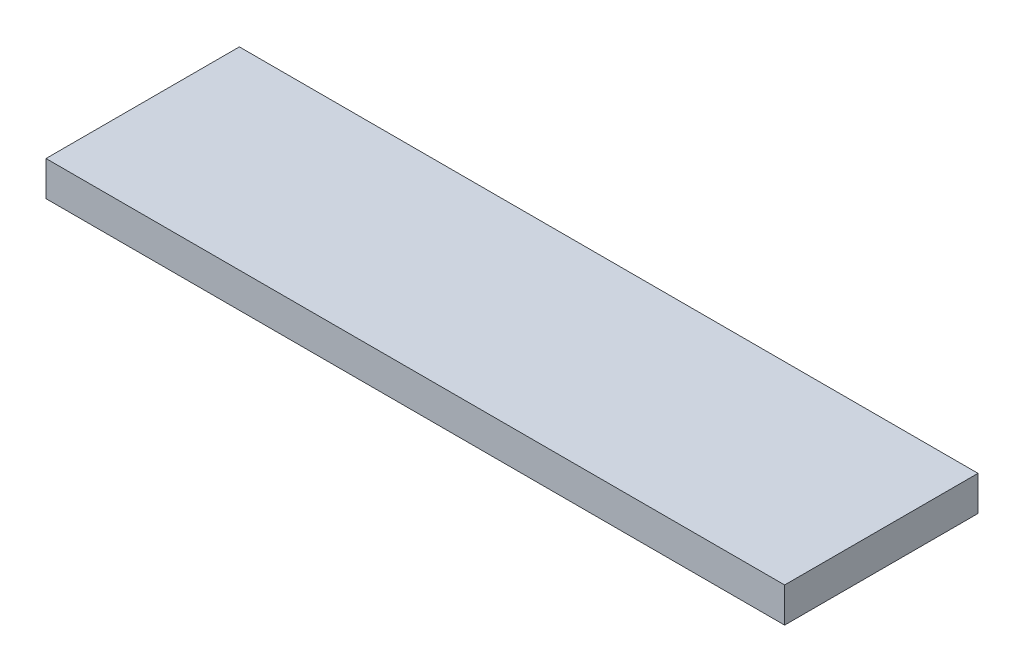
ISO-10303-21;
HEADER;
FILE_DESCRIPTION(('STEP AP214'),'2;1');
FILE_NAME('part.step','',(''),(''),'','','');
FILE_SCHEMA(('AUTOMOTIVE_DESIGN { 1 0 10303 214 1 1 1 1 }'));
ENDSEC;
DATA;
#1=APPLICATION_CONTEXT('core data for automotive mechanical design processes');
#2=APPLICATION_PROTOCOL_DEFINITION('international standard','automotive_design',2000,#1);
#3=PRODUCT_CONTEXT('',#1,'mechanical');
#4=PRODUCT('Part','Part','',(#3));
#5=PRODUCT_RELATED_PRODUCT_CATEGORY('part','',(#4));
#6=PRODUCT_DEFINITION_FORMATION('','',#4);
#7=PRODUCT_DEFINITION_CONTEXT('part definition',#1,'design');
#8=PRODUCT_DEFINITION('design','',#6,#7);
#9=PRODUCT_DEFINITION_SHAPE('','',#8);
#10=(LENGTH_UNIT() NAMED_UNIT(*) SI_UNIT(.MILLI.,.METRE.));
#11=(NAMED_UNIT(*) PLANE_ANGLE_UNIT() SI_UNIT($,.RADIAN.));
#12=(NAMED_UNIT(*) SI_UNIT($,.STERADIAN.) SOLID_ANGLE_UNIT());
#13=UNCERTAINTY_MEASURE_WITH_UNIT(LENGTH_MEASURE(1.E-05),#10,'distance_accuracy_value','');
#14=(GEOMETRIC_REPRESENTATION_CONTEXT(3) GLOBAL_UNCERTAINTY_ASSIGNED_CONTEXT((#13)) GLOBAL_UNIT_ASSIGNED_CONTEXT((#10,
#11,#12)) REPRESENTATION_CONTEXT('',''));
#15=CARTESIAN_POINT('',(0.,0.,0.));
#16=DIRECTION('',(0.,0.,1.));
#17=DIRECTION('',(1.,0.,0.));
#18=AXIS2_PLACEMENT_3D('',#15,#16,#17);
#19=CARTESIAN_POINT('',(0.,18.,0.));
#20=DIRECTION('',(1.,0.,0.));
#21=DIRECTION('',(0.,0.,-1.));
#22=AXIS2_PLACEMENT_3D('',#19,#20,#21);
#23=PLANE('',#22);
#24=DIRECTION('',(0.,0.,1.));
#25=VECTOR('',#24,1.);
#26=CARTESIAN_POINT('',(0.,0.,0.));
#27=LINE('',#26,#25);
#28=CARTESIAN_POINT('',(0.,0.,-100.));
#29=VERTEX_POINT('',#28);
#30=CARTESIAN_POINT('',(0.,0.,0.));
#31=VERTEX_POINT('',#30);
#32=EDGE_CURVE('E96',#29,#31,#27,.T.);
#33=ORIENTED_EDGE('',*,*,#32,.T.);
#34=DIRECTION('',(0.,-1.,0.));
#35=VECTOR('',#34,1.);
#36=CARTESIAN_POINT('',(0.,18.,0.));
#37=LINE('',#36,#35);
#38=CARTESIAN_POINT('',(0.,18.,0.));
#39=VERTEX_POINT('',#38);
#40=EDGE_CURVE('E11',#39,#31,#37,.T.);
#41=ORIENTED_EDGE('',*,*,#40,.F.);
#42=DIRECTION('',(0.,0.,1.));
#43=VECTOR('',#42,1.);
#44=CARTESIAN_POINT('',(0.,18.,0.));
#45=LINE('',#44,#43);
#46=CARTESIAN_POINT('',(0.,18.,-100.));
#47=VERTEX_POINT('',#46);
#48=EDGE_CURVE('E84',#47,#39,#45,.T.);
#49=ORIENTED_EDGE('',*,*,#48,.F.);
#50=DIRECTION('',(0.,-1.,0.));
#51=VECTOR('',#50,1.);
#52=CARTESIAN_POINT('',(0.,18.,-100.));
#53=LINE('',#52,#51);
#54=EDGE_CURVE('E92',#47,#29,#53,.T.);
#55=ORIENTED_EDGE('',*,*,#54,.T.);
#56=EDGE_LOOP('',(#33,#41,#49,#55));
#57=FACE_BOUND('',#56,.T.);
#58=ADVANCED_FACE('F33',(#57),#23,.F.);
#59=CARTESIAN_POINT('',(0.,18.,0.));
#60=DIRECTION('',(0.,0.,-1.));
#61=DIRECTION('',(-1.,0.,0.));
#62=AXIS2_PLACEMENT_3D('',#59,#60,#61);
#63=PLANE('',#62);
#64=DIRECTION('',(1.,0.,0.));
#65=VECTOR('',#64,1.);
#66=CARTESIAN_POINT('',(0.,0.,0.));
#67=LINE('',#66,#65);
#68=CARTESIAN_POINT('',(382.,0.,0.));
#69=VERTEX_POINT('',#68);
#70=EDGE_CURVE('E88',#31,#69,#67,.T.);
#71=ORIENTED_EDGE('',*,*,#70,.T.);
#72=DIRECTION('',(0.,-1.,0.));
#73=VECTOR('',#72,1.);
#74=CARTESIAN_POINT('',(382.,18.,0.));
#75=LINE('',#74,#73);
#76=CARTESIAN_POINT('',(382.,18.,0.));
#77=VERTEX_POINT('',#76);
#78=EDGE_CURVE('E41',#77,#69,#75,.T.);
#79=ORIENTED_EDGE('',*,*,#78,.F.);
#80=DIRECTION('',(1.,0.,0.));
#81=VECTOR('',#80,1.);
#82=CARTESIAN_POINT('',(0.,18.,0.));
#83=LINE('',#82,#81);
#84=EDGE_CURVE('E79',#39,#77,#83,.T.);
#85=ORIENTED_EDGE('',*,*,#84,.F.);
#86=ORIENTED_EDGE('',*,*,#40,.T.);
#87=EDGE_LOOP('',(#71,#79,#85,#86));
#88=FACE_BOUND('',#87,.T.);
#89=ADVANCED_FACE('F87',(#88),#63,.F.);
#90=CARTESIAN_POINT('',(382.,18.,0.));
#91=DIRECTION('',(-1.,0.,0.));
#92=DIRECTION('',(0.,0.,1.));
#93=AXIS2_PLACEMENT_3D('',#90,#91,#92);
#94=PLANE('',#93);
#95=DIRECTION('',(0.,0.,-1.));
#96=VECTOR('',#95,1.);
#97=CARTESIAN_POINT('',(382.,0.,0.));
#98=LINE('',#97,#96);
#99=CARTESIAN_POINT('',(382.,0.,-100.));
#100=VERTEX_POINT('',#99);
#101=EDGE_CURVE('E66',#69,#100,#98,.T.);
#102=ORIENTED_EDGE('',*,*,#101,.T.);
#103=DIRECTION('',(0.,-1.,0.));
#104=VECTOR('',#103,1.);
#105=CARTESIAN_POINT('',(382.,18.,-100.));
#106=LINE('',#105,#104);
#107=CARTESIAN_POINT('',(382.,18.,-100.));
#108=VERTEX_POINT('',#107);
#109=EDGE_CURVE('E89',#108,#100,#106,.T.);
#110=ORIENTED_EDGE('',*,*,#109,.F.);
#111=DIRECTION('',(0.,0.,-1.));
#112=VECTOR('',#111,1.);
#113=CARTESIAN_POINT('',(382.,18.,0.));
#114=LINE('',#113,#112);
#115=EDGE_CURVE('E82',#77,#108,#114,.T.);
#116=ORIENTED_EDGE('',*,*,#115,.F.);
#117=ORIENTED_EDGE('',*,*,#78,.T.);
#118=EDGE_LOOP('',(#102,#110,#116,#117));
#119=FACE_BOUND('',#118,.T.);
#120=ADVANCED_FACE('F90',(#119),#94,.F.);
#121=CARTESIAN_POINT('',(0.,18.,-100.));
#122=DIRECTION('',(0.,0.,1.));
#123=DIRECTION('',(1.,0.,0.));
#124=AXIS2_PLACEMENT_3D('',#121,#122,#123);
#125=PLANE('',#124);
#126=DIRECTION('',(-1.,0.,0.));
#127=VECTOR('',#126,1.);
#128=CARTESIAN_POINT('',(0.,0.,-100.));
#129=LINE('',#128,#127);
#130=EDGE_CURVE('E72',#100,#29,#129,.T.);
#131=ORIENTED_EDGE('',*,*,#130,.T.);
#132=ORIENTED_EDGE('',*,*,#54,.F.);
#133=DIRECTION('',(-1.,0.,0.));
#134=VECTOR('',#133,1.);
#135=CARTESIAN_POINT('',(0.,18.,-100.));
#136=LINE('',#135,#134);
#137=EDGE_CURVE('E49',#108,#47,#136,.T.);
#138=ORIENTED_EDGE('',*,*,#137,.F.);
#139=ORIENTED_EDGE('',*,*,#109,.T.);
#140=EDGE_LOOP('',(#131,#132,#138,#139));
#141=FACE_BOUND('',#140,.T.);
#142=ADVANCED_FACE('F103',(#141),#125,.F.);
#143=CARTESIAN_POINT('',(0.,18.,0.));
#144=DIRECTION('',(0.,-1.,0.));
#145=DIRECTION('',(0.,0.,-1.));
#146=AXIS2_PLACEMENT_3D('',#143,#144,#145);
#147=PLANE('',#146);
#148=ORIENTED_EDGE('',*,*,#48,.T.);
#149=ORIENTED_EDGE('',*,*,#84,.T.);
#150=ORIENTED_EDGE('',*,*,#115,.T.);
#151=ORIENTED_EDGE('',*,*,#137,.T.);
#152=EDGE_LOOP('',(#148,#149,#150,#151));
#153=FACE_BOUND('',#152,.T.);
#154=ADVANCED_FACE('F80',(#153),#147,.F.);
#155=CARTESIAN_POINT('',(0.,0.,0.));
#156=DIRECTION('',(0.,-1.,0.));
#157=DIRECTION('',(0.,0.,-1.));
#158=AXIS2_PLACEMENT_3D('',#155,#156,#157);
#159=PLANE('',#158);
#160=ORIENTED_EDGE('',*,*,#32,.F.);
#161=ORIENTED_EDGE('',*,*,#130,.F.);
#162=ORIENTED_EDGE('',*,*,#101,.F.);
#163=ORIENTED_EDGE('',*,*,#70,.F.);
#164=EDGE_LOOP('',(#160,#161,#162,#163));
#165=FACE_BOUND('',#164,.T.);
#166=ADVANCED_FACE('F106',(#165),#159,.T.);
#167=CLOSED_SHELL('',(#58,#89,#120,#142,#154,#166));
#168=MANIFOLD_SOLID_BREP('B2',#167);
#169=ADVANCED_BREP_SHAPE_REPRESENTATION('',(#18,#168),#14);
#170=SHAPE_DEFINITION_REPRESENTATION(#9,#169);
ENDSEC;
END-ISO-10303-21;
